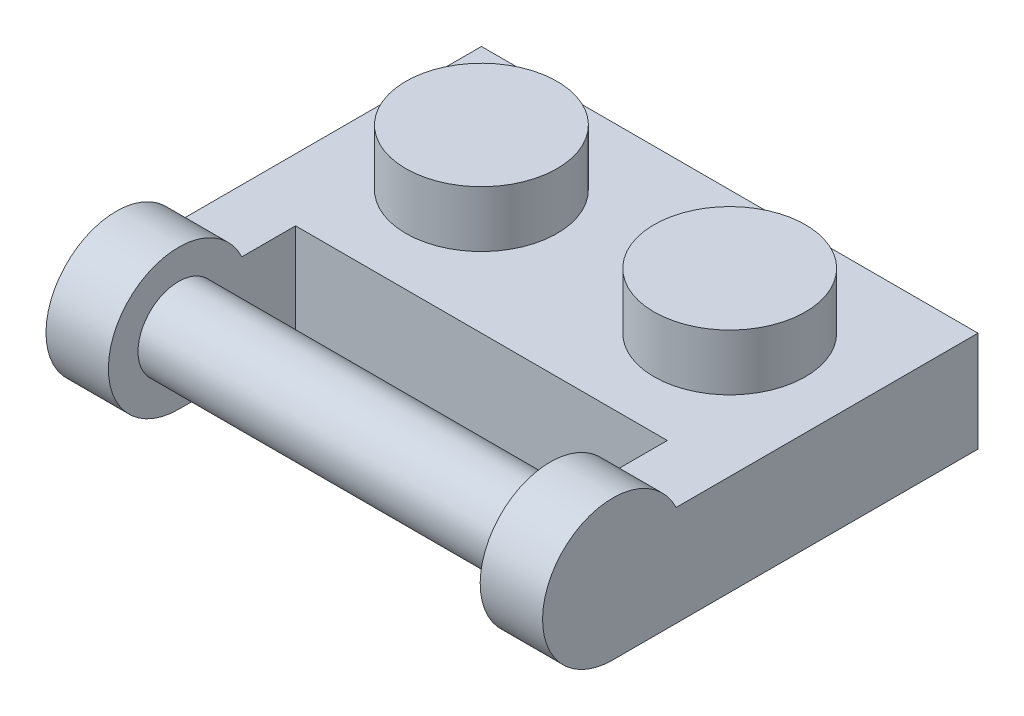
ISO-10303-21;
HEADER;
FILE_DESCRIPTION(('STEP AP214'),'2;1');
FILE_NAME('part.step','',(''),(''),'','','');
FILE_SCHEMA(('AUTOMOTIVE_DESIGN { 1 0 10303 214 1 1 1 1 }'));
ENDSEC;
DATA;
#1=APPLICATION_CONTEXT('core data for automotive mechanical design processes');
#2=APPLICATION_PROTOCOL_DEFINITION('international standard','automotive_design',2000,#1);
#3=PRODUCT_CONTEXT('',#1,'mechanical');
#4=PRODUCT('Part','Part','',(#3));
#5=PRODUCT_RELATED_PRODUCT_CATEGORY('part','',(#4));
#6=PRODUCT_DEFINITION_FORMATION('','',#4);
#7=PRODUCT_DEFINITION_CONTEXT('part definition',#1,'design');
#8=PRODUCT_DEFINITION('design','',#6,#7);
#9=PRODUCT_DEFINITION_SHAPE('','',#8);
#10=(LENGTH_UNIT() NAMED_UNIT(*) SI_UNIT(.MILLI.,.METRE.));
#11=(NAMED_UNIT(*) PLANE_ANGLE_UNIT() SI_UNIT($,.RADIAN.));
#12=(NAMED_UNIT(*) SI_UNIT($,.STERADIAN.) SOLID_ANGLE_UNIT());
#13=UNCERTAINTY_MEASURE_WITH_UNIT(LENGTH_MEASURE(1.E-05),#10,'distance_accuracy_value','');
#14=(GEOMETRIC_REPRESENTATION_CONTEXT(3) GLOBAL_UNCERTAINTY_ASSIGNED_CONTEXT((#13)) GLOBAL_UNIT_ASSIGNED_CONTEXT((#10,
#11,#12)) REPRESENTATION_CONTEXT('',''));
#15=CARTESIAN_POINT('',(0.,0.,0.));
#16=DIRECTION('',(0.,0.,1.));
#17=DIRECTION('',(1.,0.,0.));
#18=AXIS2_PLACEMENT_3D('',#15,#16,#17);
#19=CARTESIAN_POINT('',(-3.98,3.22,3.98));
#20=DIRECTION('',(0.,0.,-1.));
#21=DIRECTION('',(-1.,0.,0.));
#22=AXIS2_PLACEMENT_3D('',#19,#20,#21);
#23=PLANE('',#22);
#24=DIRECTION('',(0.,-1.,0.));
#25=VECTOR('',#24,1.);
#26=CARTESIAN_POINT('',(-1.98,3.22,3.98));
#27=LINE('',#26,#25);
#28=CARTESIAN_POINT('',(-1.98,3.22,3.98));
#29=VERTEX_POINT('',#28);
#30=CARTESIAN_POINT('',(-1.98,0.,3.98000000000001));
#31=VERTEX_POINT('',#30);
#32=EDGE_CURVE('E139',#29,#31,#27,.T.);
#33=ORIENTED_EDGE('',*,*,#32,.T.);
#34=DIRECTION('',(1.,0.,0.));
#35=VECTOR('',#34,1.);
#36=CARTESIAN_POINT('',(-3.98,0.,3.98));
#37=LINE('',#36,#35);
#38=CARTESIAN_POINT('',(9.94,0.,3.98));
#39=VERTEX_POINT('',#38);
#40=EDGE_CURVE('E127',#31,#39,#37,.T.);
#41=ORIENTED_EDGE('',*,*,#40,.T.);
#42=DIRECTION('',(0.,1.,0.));
#43=VECTOR('',#42,1.);
#44=CARTESIAN_POINT('',(9.94,3.22,3.98));
#45=LINE('',#44,#43);
#46=CARTESIAN_POINT('',(9.94,3.22,3.98));
#47=VERTEX_POINT('',#46);
#48=EDGE_CURVE('E166',#39,#47,#45,.T.);
#49=ORIENTED_EDGE('',*,*,#48,.T.);
#50=DIRECTION('',(1.,0.,0.));
#51=VECTOR('',#50,1.);
#52=CARTESIAN_POINT('',(-3.98,3.22,3.98));
#53=LINE('',#52,#51);
#54=EDGE_CURVE('E52',#29,#47,#53,.T.);
#55=ORIENTED_EDGE('',*,*,#54,.F.);
#56=EDGE_LOOP('',(#33,#41,#49,#55));
#57=FACE_BOUND('',#56,.T.);
#58=ADVANCED_FACE('F35',(#57),#23,.F.);
#59=CARTESIAN_POINT('',(10.39,1.81,2.43));
#60=DIRECTION('',(0.,1.,0.));
#61=DIRECTION('',(0.,0.,1.));
#62=AXIS2_PLACEMENT_3D('',#59,#60,#61);
#63=PLANE('',#62);
#64=CARTESIAN_POINT('',(0.,1.81,0.));
#65=DIRECTION('',(0.,1.,0.));
#66=DIRECTION('',(0.,0.,1.));
#67=AXIS2_PLACEMENT_3D('',#64,#65,#66);
#68=CIRCLE('',#67,0.875);
#69=CARTESIAN_POINT('',(0.,1.81,0.875));
#70=VERTEX_POINT('',#69);
#71=EDGE_CURVE('E185',#70,#70,#68,.T.);
#72=ORIENTED_EDGE('',*,*,#71,.T.);
#73=EDGE_LOOP('',(#72));
#74=FACE_BOUND('',#73,.T.);
#75=CARTESIAN_POINT('',(7.96,1.81,0.));
#76=DIRECTION('',(0.,1.,0.));
#77=DIRECTION('',(0.,0.,1.));
#78=AXIS2_PLACEMENT_3D('',#75,#76,#77);
#79=CIRCLE('',#78,0.875);
#80=CARTESIAN_POINT('',(7.96,1.81,0.875));
#81=VERTEX_POINT('',#80);
#82=EDGE_CURVE('E183',#81,#81,#79,.T.);
#83=ORIENTED_EDGE('',*,*,#82,.T.);
#84=EDGE_LOOP('',(#83));
#85=FACE_BOUND('',#84,.T.);
#86=DIRECTION('',(-1.,0.,0.));
#87=VECTOR('',#86,1.);
#88=CARTESIAN_POINT('',(-2.43,1.81,2.43));
#89=LINE('',#88,#87);
#90=CARTESIAN_POINT('',(10.39,1.81,2.43));
#91=VERTEX_POINT('',#90);
#92=CARTESIAN_POINT('',(-2.43,1.81,2.43));
#93=VERTEX_POINT('',#92);
#94=EDGE_CURVE('E608',#91,#93,#89,.T.);
#95=ORIENTED_EDGE('',*,*,#94,.T.);
#96=DIRECTION('',(0.,0.,-1.));
#97=VECTOR('',#96,1.);
#98=CARTESIAN_POINT('',(-2.43,1.81,-2.43));
#99=LINE('',#98,#97);
#100=CARTESIAN_POINT('',(-2.43,1.81,-2.43));
#101=VERTEX_POINT('',#100);
#102=EDGE_CURVE('E199',#93,#101,#99,.T.);
#103=ORIENTED_EDGE('',*,*,#102,.T.);
#104=DIRECTION('',(1.,0.,0.));
#105=VECTOR('',#104,1.);
#106=CARTESIAN_POINT('',(10.39,1.81,-2.43));
#107=LINE('',#106,#105);
#108=CARTESIAN_POINT('',(10.39,1.81,-2.43));
#109=VERTEX_POINT('',#108);
#110=EDGE_CURVE('E193',#101,#109,#107,.T.);
#111=ORIENTED_EDGE('',*,*,#110,.T.);
#112=DIRECTION('',(0.,0.,1.));
#113=VECTOR('',#112,1.);
#114=CARTESIAN_POINT('',(10.39,1.81,2.43));
#115=LINE('',#114,#113);
#116=EDGE_CURVE('E186',#109,#91,#115,.T.);
#117=ORIENTED_EDGE('',*,*,#116,.T.);
#118=EDGE_LOOP('',(#95,#103,#111,#117));
#119=FACE_BOUND('',#118,.T.);
#120=CARTESIAN_POINT('',(3.98,1.81,0.));
#121=DIRECTION('',(0.,1.,0.));
#122=DIRECTION('',(0.,0.,1.));
#123=AXIS2_PLACEMENT_3D('',#120,#121,#122);
#124=CIRCLE('',#123,1.5);
#125=CARTESIAN_POINT('',(3.98,1.81,1.5));
#126=VERTEX_POINT('',#125);
#127=EDGE_CURVE('E11',#126,#126,#124,.F.);
#128=ORIENTED_EDGE('',*,*,#127,.F.);
#129=EDGE_LOOP('',(#128));
#130=FACE_BOUND('',#129,.T.);
#131=ADVANCED_FACE('F283',(#74,#85,#119,#130),#63,.F.);
#132=CARTESIAN_POINT('',(3.98,3.22,3.98));
#133=DIRECTION('',(0.,1.,0.));
#134=DIRECTION('',(0.,0.,1.));
#135=AXIS2_PLACEMENT_3D('',#132,#133,#134);
#136=PLANE('',#135);
#137=CARTESIAN_POINT('',(0.,3.22,0.));
#138=DIRECTION('',(0.,1.,0.));
#139=DIRECTION('',(0.,0.,1.));
#140=AXIS2_PLACEMENT_3D('',#137,#138,#139);
#141=CIRCLE('',#140,2.425);
#142=CARTESIAN_POINT('',(0.,3.22,2.425));
#143=VERTEX_POINT('',#142);
#144=EDGE_CURVE('E245',#143,#143,#141,.T.);
#145=ORIENTED_EDGE('',*,*,#144,.F.);
#146=EDGE_LOOP('',(#145));
#147=FACE_BOUND('',#146,.T.);
#148=DIRECTION('',(0.,0.,1.));
#149=VECTOR('',#148,1.);
#150=CARTESIAN_POINT('',(-3.98,3.22,-3.98));
#151=LINE('',#150,#149);
#152=CARTESIAN_POINT('',(-3.98,3.22,-3.98));
#153=VERTEX_POINT('',#152);
#154=CARTESIAN_POINT('',(-3.98,3.22,5.69982759352808));
#155=VERTEX_POINT('',#154);
#156=EDGE_CURVE('E253',#153,#155,#151,.T.);
#157=ORIENTED_EDGE('',*,*,#156,.T.);
#158=DIRECTION('',(-1.,0.,0.));
#159=VECTOR('',#158,1.);
#160=CARTESIAN_POINT('',(-1.98,3.22,5.69982759352808));
#161=LINE('',#160,#159);
#162=CARTESIAN_POINT('',(-1.98,3.22,5.69982759352808));
#163=VERTEX_POINT('',#162);
#164=EDGE_CURVE('E156',#163,#155,#161,.T.);
#165=ORIENTED_EDGE('',*,*,#164,.F.);
#166=DIRECTION('',(0.,0.,-1.));
#167=VECTOR('',#166,1.);
#168=CARTESIAN_POINT('',(-1.98,3.22,3.98));
#169=LINE('',#168,#167);
#170=EDGE_CURVE('E142',#163,#29,#169,.T.);
#171=ORIENTED_EDGE('',*,*,#170,.T.);
#172=ORIENTED_EDGE('',*,*,#54,.T.);
#173=DIRECTION('',(0.,0.,1.));
#174=VECTOR('',#173,1.);
#175=CARTESIAN_POINT('',(9.94,3.22,3.98));
#176=LINE('',#175,#174);
#177=CARTESIAN_POINT('',(9.94,3.22,5.69982759352808));
#178=VERTEX_POINT('',#177);
#179=EDGE_CURVE('E168',#47,#178,#176,.T.);
#180=ORIENTED_EDGE('',*,*,#179,.T.);
#181=DIRECTION('',(1.,0.,0.));
#182=VECTOR('',#181,1.);
#183=CARTESIAN_POINT('',(9.94,3.22,5.69982759352808));
#184=LINE('',#183,#182);
#185=CARTESIAN_POINT('',(11.94,3.22,5.69982759352808));
#186=VERTEX_POINT('',#185);
#187=EDGE_CURVE('E174',#178,#186,#184,.T.);
#188=ORIENTED_EDGE('',*,*,#187,.T.);
#189=DIRECTION('',(0.,0.,-1.));
#190=VECTOR('',#189,1.);
#191=CARTESIAN_POINT('',(11.94,3.22,-3.98));
#192=LINE('',#191,#190);
#193=CARTESIAN_POINT('',(11.94,3.22,-3.98));
#194=VERTEX_POINT('',#193);
#195=EDGE_CURVE('E237',#186,#194,#192,.T.);
#196=ORIENTED_EDGE('',*,*,#195,.T.);
#197=DIRECTION('',(-1.,0.,0.));
#198=VECTOR('',#197,1.);
#199=CARTESIAN_POINT('',(-3.98,3.22,-3.98));
#200=LINE('',#199,#198);
#201=EDGE_CURVE('E136',#194,#153,#200,.T.);
#202=ORIENTED_EDGE('',*,*,#201,.T.);
#203=EDGE_LOOP('',(#157,#165,#171,#172,#180,#188,#196,#202));
#204=FACE_BOUND('',#203,.T.);
#205=CARTESIAN_POINT('',(7.96,3.22,0.));
#206=DIRECTION('',(0.,1.,0.));
#207=DIRECTION('',(0.,0.,1.));
#208=AXIS2_PLACEMENT_3D('',#205,#206,#207);
#209=CIRCLE('',#208,2.425);
#210=CARTESIAN_POINT('',(7.96,3.22,2.425));
#211=VERTEX_POINT('',#210);
#212=EDGE_CURVE('E205',#211,#211,#209,.T.);
#213=ORIENTED_EDGE('',*,*,#212,.F.);
#214=EDGE_LOOP('',(#213));
#215=FACE_BOUND('',#214,.T.);
#216=ADVANCED_FACE('F264',(#147,#204,#215),#136,.T.);
#217=CARTESIAN_POINT('',(-3.98,3.22,-3.98));
#218=DIRECTION('',(0.,0.,1.));
#219=DIRECTION('',(1.,0.,0.));
#220=AXIS2_PLACEMENT_3D('',#217,#218,#219);
#221=PLANE('',#220);
#222=DIRECTION('',(-1.,0.,0.));
#223=VECTOR('',#222,1.);
#224=CARTESIAN_POINT('',(-3.98,0.,-3.98));
#225=LINE('',#224,#223);
#226=CARTESIAN_POINT('',(11.94,0.,-3.98));
#227=VERTEX_POINT('',#226);
#228=CARTESIAN_POINT('',(-3.98,0.,-3.98));
#229=VERTEX_POINT('',#228);
#230=EDGE_CURVE('E249',#227,#229,#225,.T.);
#231=ORIENTED_EDGE('',*,*,#230,.T.);
#232=DIRECTION('',(0.,-1.,0.));
#233=VECTOR('',#232,1.);
#234=CARTESIAN_POINT('',(-3.98,3.22,-3.98));
#235=LINE('',#234,#233);
#236=EDGE_CURVE('E44',#153,#229,#235,.T.);
#237=ORIENTED_EDGE('',*,*,#236,.F.);
#238=ORIENTED_EDGE('',*,*,#201,.F.);
#239=DIRECTION('',(0.,-1.,0.));
#240=VECTOR('',#239,1.);
#241=CARTESIAN_POINT('',(11.94,3.22,-3.98));
#242=LINE('',#241,#240);
#243=EDGE_CURVE('E240',#194,#227,#242,.T.);
#244=ORIENTED_EDGE('',*,*,#243,.T.);
#245=EDGE_LOOP('',(#231,#237,#238,#244));
#246=FACE_BOUND('',#245,.T.);
#247=ADVANCED_FACE('F37',(#246),#221,.F.);
#248=CARTESIAN_POINT('',(-3.98,3.22,-3.98));
#249=DIRECTION('',(1.,0.,0.));
#250=DIRECTION('',(0.,0.,-1.));
#251=AXIS2_PLACEMENT_3D('',#248,#249,#250);
#252=PLANE('',#251);
#253=DIRECTION('',(0.,0.,1.));
#254=VECTOR('',#253,1.);
#255=CARTESIAN_POINT('',(-3.98,0.,-3.98));
#256=LINE('',#255,#254);
#257=CARTESIAN_POINT('',(-3.98,0.,7.73));
#258=VERTEX_POINT('',#257);
#259=EDGE_CURVE('E137',#229,#258,#256,.T.);
#260=ORIENTED_EDGE('',*,*,#259,.T.);
#261=CARTESIAN_POINT('',(-3.98,2.25,7.73));
#262=DIRECTION('',(-1.,0.,0.));
#263=DIRECTION('',(0.,0.,1.));
#264=AXIS2_PLACEMENT_3D('',#261,#262,#263);
#265=CIRCLE('',#264,2.25);
#266=EDGE_CURVE('E152',#258,#155,#265,.T.);
#267=ORIENTED_EDGE('',*,*,#266,.T.);
#268=ORIENTED_EDGE('',*,*,#156,.F.);
#269=ORIENTED_EDGE('',*,*,#236,.T.);
#270=EDGE_LOOP('',(#260,#267,#268,#269));
#271=FACE_BOUND('',#270,.T.);
#272=ADVANCED_FACE('F259',(#271),#252,.F.);
#273=CARTESIAN_POINT('',(3.98,0.,3.98));
#274=DIRECTION('',(0.,1.,0.));
#275=DIRECTION('',(0.,0.,1.));
#276=AXIS2_PLACEMENT_3D('',#273,#274,#275);
#277=PLANE('',#276);
#278=DIRECTION('',(0.,0.,-1.));
#279=VECTOR('',#278,1.);
#280=CARTESIAN_POINT('',(10.39,0.,-3.98));
#281=LINE('',#280,#279);
#282=CARTESIAN_POINT('',(10.39,0.,2.43));
#283=VERTEX_POINT('',#282);
#284=CARTESIAN_POINT('',(10.39,0.,-2.43));
#285=VERTEX_POINT('',#284);
#286=EDGE_CURVE('E216',#283,#285,#281,.T.);
#287=ORIENTED_EDGE('',*,*,#286,.T.);
#288=DIRECTION('',(-1.,0.,0.));
#289=VECTOR('',#288,1.);
#290=CARTESIAN_POINT('',(-3.98,0.,-2.43));
#291=LINE('',#290,#289);
#292=CARTESIAN_POINT('',(-2.43,0.,-2.43));
#293=VERTEX_POINT('',#292);
#294=EDGE_CURVE('E219',#285,#293,#291,.T.);
#295=ORIENTED_EDGE('',*,*,#294,.T.);
#296=DIRECTION('',(0.,0.,1.));
#297=VECTOR('',#296,1.);
#298=CARTESIAN_POINT('',(-2.43,0.,-3.98));
#299=LINE('',#298,#297);
#300=CARTESIAN_POINT('',(-2.43,0.,2.43));
#301=VERTEX_POINT('',#300);
#302=EDGE_CURVE('E224',#293,#301,#299,.T.);
#303=ORIENTED_EDGE('',*,*,#302,.T.);
#304=DIRECTION('',(1.,0.,0.));
#305=VECTOR('',#304,1.);
#306=CARTESIAN_POINT('',(-3.98,0.,2.43));
#307=LINE('',#306,#305);
#308=EDGE_CURVE('E214',#301,#283,#307,.T.);
#309=ORIENTED_EDGE('',*,*,#308,.T.);
#310=EDGE_LOOP('',(#287,#295,#303,#309));
#311=FACE_BOUND('',#310,.T.);
#312=ORIENTED_EDGE('',*,*,#230,.F.);
#313=DIRECTION('',(0.,0.,-1.));
#314=VECTOR('',#313,1.);
#315=CARTESIAN_POINT('',(11.94,0.,-3.98));
#316=LINE('',#315,#314);
#317=CARTESIAN_POINT('',(11.94,0.,7.73));
#318=VERTEX_POINT('',#317);
#319=EDGE_CURVE('E236',#318,#227,#316,.T.);
#320=ORIENTED_EDGE('',*,*,#319,.F.);
#321=DIRECTION('',(1.,0.,0.));
#322=VECTOR('',#321,1.);
#323=CARTESIAN_POINT('',(9.94,0.,7.73));
#324=LINE('',#323,#322);
#325=CARTESIAN_POINT('',(9.94,0.,7.73));
#326=VERTEX_POINT('',#325);
#327=EDGE_CURVE('E593',#326,#318,#324,.T.);
#328=ORIENTED_EDGE('',*,*,#327,.F.);
#329=DIRECTION('',(0.,0.,-1.));
#330=VECTOR('',#329,1.);
#331=CARTESIAN_POINT('',(9.94,0.,7.73));
#332=LINE('',#331,#330);
#333=EDGE_CURVE('E134',#326,#39,#332,.T.);
#334=ORIENTED_EDGE('',*,*,#333,.T.);
#335=ORIENTED_EDGE('',*,*,#40,.F.);
#336=DIRECTION('',(0.,0.,1.));
#337=VECTOR('',#336,1.);
#338=CARTESIAN_POINT('',(-1.98,0.,7.73));
#339=LINE('',#338,#337);
#340=CARTESIAN_POINT('',(-1.98,0.,7.73));
#341=VERTEX_POINT('',#340);
#342=EDGE_CURVE('E131',#31,#341,#339,.T.);
#343=ORIENTED_EDGE('',*,*,#342,.T.);
#344=DIRECTION('',(-1.,0.,0.));
#345=VECTOR('',#344,1.);
#346=CARTESIAN_POINT('',(-1.98,0.,7.73));
#347=LINE('',#346,#345);
#348=EDGE_CURVE('E148',#341,#258,#347,.T.);
#349=ORIENTED_EDGE('',*,*,#348,.T.);
#350=ORIENTED_EDGE('',*,*,#259,.F.);
#351=EDGE_LOOP('',(#312,#320,#328,#334,#335,#343,#349,#350));
#352=FACE_BOUND('',#351,.T.);
#353=ADVANCED_FACE('F128',(#311,#352),#277,.F.);
#354=CARTESIAN_POINT('',(0.,5.02,0.));
#355=DIRECTION('',(0.,-1.,0.));
#356=DIRECTION('',(0.,0.,-1.));
#357=AXIS2_PLACEMENT_3D('',#354,#355,#356);
#358=CYLINDRICAL_SURFACE('',#357,2.425);
#359=CARTESIAN_POINT('',(0.,5.02,0.));
#360=DIRECTION('',(0.,1.,0.));
#361=DIRECTION('',(0.,0.,1.));
#362=AXIS2_PLACEMENT_3D('',#359,#360,#361);
#363=CIRCLE('',#362,2.425);
#364=CARTESIAN_POINT('',(0.,5.02,2.425));
#365=VERTEX_POINT('',#364);
#366=EDGE_CURVE('E246',#365,#365,#363,.T.);
#367=ORIENTED_EDGE('',*,*,#366,.F.);
#368=EDGE_LOOP('',(#367));
#369=FACE_BOUND('',#368,.T.);
#370=ORIENTED_EDGE('',*,*,#144,.T.);
#371=EDGE_LOOP('',(#370));
#372=FACE_BOUND('',#371,.T.);
#373=ADVANCED_FACE('F298',(#369,#372),#358,.T.);
#374=CARTESIAN_POINT('',(0.,5.02,0.));
#375=DIRECTION('',(0.,1.,0.));
#376=DIRECTION('',(0.,0.,1.));
#377=AXIS2_PLACEMENT_3D('',#374,#375,#376);
#378=PLANE('',#377);
#379=ORIENTED_EDGE('',*,*,#366,.T.);
#380=EDGE_LOOP('',(#379));
#381=FACE_BOUND('',#380,.T.);
#382=ADVANCED_FACE('F310',(#381),#378,.T.);
#383=CARTESIAN_POINT('',(11.94,3.22,-3.98));
#384=DIRECTION('',(-1.,0.,0.));
#385=DIRECTION('',(0.,0.,1.));
#386=AXIS2_PLACEMENT_3D('',#383,#384,#385);
#387=PLANE('',#386);
#388=ORIENTED_EDGE('',*,*,#319,.T.);
#389=ORIENTED_EDGE('',*,*,#243,.F.);
#390=ORIENTED_EDGE('',*,*,#195,.F.);
#391=CARTESIAN_POINT('',(11.94,2.25,7.73));
#392=DIRECTION('',(1.,0.,0.));
#393=DIRECTION('',(0.,0.,-1.));
#394=AXIS2_PLACEMENT_3D('',#391,#392,#393);
#395=CIRCLE('',#394,2.25);
#396=EDGE_CURVE('E159',#186,#318,#395,.T.);
#397=ORIENTED_EDGE('',*,*,#396,.T.);
#398=EDGE_LOOP('',(#388,#389,#390,#397));
#399=FACE_BOUND('',#398,.T.);
#400=ADVANCED_FACE('F314',(#399),#387,.F.);
#401=CARTESIAN_POINT('',(7.96,5.02,0.));
#402=DIRECTION('',(0.,-1.,0.));
#403=DIRECTION('',(0.,0.,-1.));
#404=AXIS2_PLACEMENT_3D('',#401,#402,#403);
#405=CYLINDRICAL_SURFACE('',#404,2.425);
#406=CARTESIAN_POINT('',(7.96,5.02,0.));
#407=DIRECTION('',(0.,1.,0.));
#408=DIRECTION('',(0.,0.,1.));
#409=AXIS2_PLACEMENT_3D('',#406,#407,#408);
#410=CIRCLE('',#409,2.425);
#411=CARTESIAN_POINT('',(7.96,5.02,2.425));
#412=VERTEX_POINT('',#411);
#413=EDGE_CURVE('E233',#412,#412,#410,.T.);
#414=ORIENTED_EDGE('',*,*,#413,.F.);
#415=EDGE_LOOP('',(#414));
#416=FACE_BOUND('',#415,.T.);
#417=ORIENTED_EDGE('',*,*,#212,.T.);
#418=EDGE_LOOP('',(#417));
#419=FACE_BOUND('',#418,.T.);
#420=ADVANCED_FACE('F318',(#416,#419),#405,.T.);
#421=CARTESIAN_POINT('',(7.96,5.02,0.));
#422=DIRECTION('',(0.,1.,0.));
#423=DIRECTION('',(0.,0.,1.));
#424=AXIS2_PLACEMENT_3D('',#421,#422,#423);
#425=PLANE('',#424);
#426=ORIENTED_EDGE('',*,*,#413,.T.);
#427=EDGE_LOOP('',(#426));
#428=FACE_BOUND('',#427,.T.);
#429=ADVANCED_FACE('F320',(#428),#425,.T.);
#430=CARTESIAN_POINT('',(-3.98,3.22,-2.43));
#431=DIRECTION('',(0.,0.,1.));
#432=DIRECTION('',(1.,0.,0.));
#433=AXIS2_PLACEMENT_3D('',#430,#431,#432);
#434=PLANE('',#433);
#435=ORIENTED_EDGE('',*,*,#294,.F.);
#436=DIRECTION('',(0.,-1.,0.));
#437=VECTOR('',#436,1.);
#438=CARTESIAN_POINT('',(10.39,3.22,-2.43));
#439=LINE('',#438,#437);
#440=EDGE_CURVE('E207',#109,#285,#439,.T.);
#441=ORIENTED_EDGE('',*,*,#440,.F.);
#442=ORIENTED_EDGE('',*,*,#110,.F.);
#443=DIRECTION('',(0.,-1.,0.));
#444=VECTOR('',#443,1.);
#445=CARTESIAN_POINT('',(-2.43,3.22,-2.43));
#446=LINE('',#445,#444);
#447=EDGE_CURVE('E203',#101,#293,#446,.T.);
#448=ORIENTED_EDGE('',*,*,#447,.T.);
#449=EDGE_LOOP('',(#435,#441,#442,#448));
#450=FACE_BOUND('',#449,.T.);
#451=ADVANCED_FACE('F324',(#450),#434,.T.);
#452=CARTESIAN_POINT('',(-2.43,3.22,-3.98));
#453=DIRECTION('',(1.,0.,0.));
#454=DIRECTION('',(0.,0.,-1.));
#455=AXIS2_PLACEMENT_3D('',#452,#453,#454);
#456=PLANE('',#455);
#457=ORIENTED_EDGE('',*,*,#302,.F.);
#458=ORIENTED_EDGE('',*,*,#447,.F.);
#459=ORIENTED_EDGE('',*,*,#102,.F.);
#460=DIRECTION('',(0.,-1.,0.));
#461=VECTOR('',#460,1.);
#462=CARTESIAN_POINT('',(-2.43,3.22,2.43));
#463=LINE('',#462,#461);
#464=EDGE_CURVE('E206',#93,#301,#463,.T.);
#465=ORIENTED_EDGE('',*,*,#464,.T.);
#466=EDGE_LOOP('',(#457,#458,#459,#465));
#467=FACE_BOUND('',#466,.T.);
#468=ADVANCED_FACE('F352',(#467),#456,.T.);
#469=CARTESIAN_POINT('',(-3.98,3.22,2.43));
#470=DIRECTION('',(0.,0.,-1.));
#471=DIRECTION('',(-1.,0.,0.));
#472=AXIS2_PLACEMENT_3D('',#469,#470,#471);
#473=PLANE('',#472);
#474=ORIENTED_EDGE('',*,*,#308,.F.);
#475=ORIENTED_EDGE('',*,*,#464,.F.);
#476=ORIENTED_EDGE('',*,*,#94,.F.);
#477=DIRECTION('',(0.,-1.,0.));
#478=VECTOR('',#477,1.);
#479=CARTESIAN_POINT('',(10.39,3.22,2.43));
#480=LINE('',#479,#478);
#481=EDGE_CURVE('E211',#91,#283,#480,.T.);
#482=ORIENTED_EDGE('',*,*,#481,.T.);
#483=EDGE_LOOP('',(#474,#475,#476,#482));
#484=FACE_BOUND('',#483,.T.);
#485=ADVANCED_FACE('F342',(#484),#473,.T.);
#486=CARTESIAN_POINT('',(10.39,3.22,-3.98));
#487=DIRECTION('',(-1.,0.,0.));
#488=DIRECTION('',(0.,0.,1.));
#489=AXIS2_PLACEMENT_3D('',#486,#487,#488);
#490=PLANE('',#489);
#491=ORIENTED_EDGE('',*,*,#286,.F.);
#492=ORIENTED_EDGE('',*,*,#481,.F.);
#493=ORIENTED_EDGE('',*,*,#116,.F.);
#494=ORIENTED_EDGE('',*,*,#440,.T.);
#495=EDGE_LOOP('',(#491,#492,#493,#494));
#496=FACE_BOUND('',#495,.T.);
#497=ADVANCED_FACE('F338',(#496),#490,.T.);
#498=CARTESIAN_POINT('',(0.,3.47,0.));
#499=DIRECTION('',(0.,1.,0.));
#500=DIRECTION('',(0.,0.,1.));
#501=AXIS2_PLACEMENT_3D('',#498,#499,#500);
#502=PLANE('',#501);
#503=CARTESIAN_POINT('',(0.,3.47,0.));
#504=DIRECTION('',(0.,1.,0.));
#505=DIRECTION('',(0.,0.,1.));
#506=AXIS2_PLACEMENT_3D('',#503,#504,#505);
#507=CIRCLE('',#506,0.875);
#508=CARTESIAN_POINT('',(0.,3.47,0.875));
#509=VERTEX_POINT('',#508);
#510=EDGE_CURVE('E210',#509,#509,#507,.T.);
#511=ORIENTED_EDGE('',*,*,#510,.F.);
#512=EDGE_LOOP('',(#511));
#513=FACE_BOUND('',#512,.T.);
#514=ADVANCED_FACE('F341',(#513),#502,.F.);
#515=CARTESIAN_POINT('',(0.,5.02,0.));
#516=DIRECTION('',(0.,-1.,0.));
#517=DIRECTION('',(0.,0.,-1.));
#518=AXIS2_PLACEMENT_3D('',#515,#516,#517);
#519=CYLINDRICAL_SURFACE('',#518,0.875);
#520=ORIENTED_EDGE('',*,*,#71,.F.);
#521=EDGE_LOOP('',(#520));
#522=FACE_BOUND('',#521,.T.);
#523=ORIENTED_EDGE('',*,*,#510,.T.);
#524=EDGE_LOOP('',(#523));
#525=FACE_BOUND('',#524,.T.);
#526=ADVANCED_FACE('F332',(#522,#525),#519,.F.);
#527=CARTESIAN_POINT('',(7.96,3.47,0.));
#528=DIRECTION('',(0.,1.,0.));
#529=DIRECTION('',(0.,0.,1.));
#530=AXIS2_PLACEMENT_3D('',#527,#528,#529);
#531=PLANE('',#530);
#532=CARTESIAN_POINT('',(7.96,3.47,0.));
#533=DIRECTION('',(0.,1.,0.));
#534=DIRECTION('',(0.,0.,1.));
#535=AXIS2_PLACEMENT_3D('',#532,#533,#534);
#536=CIRCLE('',#535,0.875);
#537=CARTESIAN_POINT('',(7.96,3.47,0.875));
#538=VERTEX_POINT('',#537);
#539=EDGE_CURVE('E190',#538,#538,#536,.T.);
#540=ORIENTED_EDGE('',*,*,#539,.F.);
#541=EDGE_LOOP('',(#540));
#542=FACE_BOUND('',#541,.T.);
#543=ADVANCED_FACE('F328',(#542),#531,.F.);
#544=CARTESIAN_POINT('',(7.96,5.02,0.));
#545=DIRECTION('',(0.,-1.,0.));
#546=DIRECTION('',(0.,0.,-1.));
#547=AXIS2_PLACEMENT_3D('',#544,#545,#546);
#548=CYLINDRICAL_SURFACE('',#547,0.875);
#549=ORIENTED_EDGE('',*,*,#82,.F.);
#550=EDGE_LOOP('',(#549));
#551=FACE_BOUND('',#550,.T.);
#552=ORIENTED_EDGE('',*,*,#539,.T.);
#553=EDGE_LOOP('',(#552));
#554=FACE_BOUND('',#553,.T.);
#555=ADVANCED_FACE('F331',(#551,#554),#548,.F.);
#556=CARTESIAN_POINT('',(3.98,-4.24264068711928,0.));
#557=DIRECTION('',(0.,1.,0.));
#558=DIRECTION('',(0.,0.,1.));
#559=AXIS2_PLACEMENT_3D('',#556,#557,#558);
#560=CYLINDRICAL_SURFACE('',#559,1.5);
#561=CARTESIAN_POINT('',(3.98,0.,0.));
#562=DIRECTION('',(0.,1.,0.));
#563=DIRECTION('',(0.,0.,1.));
#564=AXIS2_PLACEMENT_3D('',#561,#562,#563);
#565=CIRCLE('',#564,1.5);
#566=CARTESIAN_POINT('',(3.98,0.,1.5));
#567=VERTEX_POINT('',#566);
#568=EDGE_CURVE('E602',#567,#567,#565,.T.);
#569=ORIENTED_EDGE('',*,*,#568,.T.);
#570=EDGE_LOOP('',(#569));
#571=FACE_BOUND('',#570,.T.);
#572=ORIENTED_EDGE('',*,*,#127,.T.);
#573=EDGE_LOOP('',(#572));
#574=FACE_BOUND('',#573,.T.);
#575=ADVANCED_FACE('F336',(#571,#574),#560,.T.);
#576=CARTESIAN_POINT('',(3.98,-4.24264068711928,0.));
#577=DIRECTION('',(0.,1.,0.));
#578=DIRECTION('',(0.,0.,1.));
#579=AXIS2_PLACEMENT_3D('',#576,#577,#578);
#580=CYLINDRICAL_SURFACE('',#579,0.64);
#581=CARTESIAN_POINT('',(3.98,0.,0.));
#582=DIRECTION('',(0.,1.,0.));
#583=DIRECTION('',(0.,0.,1.));
#584=AXIS2_PLACEMENT_3D('',#581,#582,#583);
#585=CIRCLE('',#584,0.64);
#586=CARTESIAN_POINT('',(3.98,0.,0.64));
#587=VERTEX_POINT('',#586);
#588=EDGE_CURVE('E605',#587,#587,#585,.T.);
#589=ORIENTED_EDGE('',*,*,#588,.F.);
#590=EDGE_LOOP('',(#589));
#591=FACE_BOUND('',#590,.T.);
#592=CARTESIAN_POINT('',(3.98,1.81,0.));
#593=DIRECTION('',(0.,-1.,0.));
#594=DIRECTION('',(0.,0.,-1.));
#595=AXIS2_PLACEMENT_3D('',#592,#593,#594);
#596=CIRCLE('',#595,0.64);
#597=CARTESIAN_POINT('',(3.98,1.81,-0.64));
#598=VERTEX_POINT('',#597);
#599=EDGE_CURVE('E598',#598,#598,#596,.T.);
#600=ORIENTED_EDGE('',*,*,#599,.F.);
#601=EDGE_LOOP('',(#600));
#602=FACE_BOUND('',#601,.T.);
#603=ADVANCED_FACE('F366',(#591,#602),#580,.F.);
#604=CARTESIAN_POINT('',(3.98,0.,3.98));
#605=DIRECTION('',(0.,1.,0.));
#606=DIRECTION('',(0.,0.,1.));
#607=AXIS2_PLACEMENT_3D('',#604,#605,#606);
#608=PLANE('',#607);
#609=ORIENTED_EDGE('',*,*,#588,.T.);
#610=EDGE_LOOP('',(#609));
#611=FACE_BOUND('',#610,.T.);
#612=ORIENTED_EDGE('',*,*,#568,.F.);
#613=EDGE_LOOP('',(#612));
#614=FACE_BOUND('',#613,.T.);
#615=ADVANCED_FACE('F362',(#611,#614),#608,.F.);
#616=ORIENTED_EDGE('',*,*,#599,.T.);
#617=EDGE_LOOP('',(#616));
#618=FACE_BOUND('',#617,.T.);
#619=ADVANCED_FACE('F290',(#618),#63,.F.);
#620=CARTESIAN_POINT('',(9.94,2.25,7.73));
#621=DIRECTION('',(1.,0.,0.));
#622=DIRECTION('',(0.,0.,-1.));
#623=AXIS2_PLACEMENT_3D('',#620,#621,#622);
#624=CYLINDRICAL_SURFACE('',#623,2.25);
#625=ORIENTED_EDGE('',*,*,#396,.F.);
#626=ORIENTED_EDGE('',*,*,#187,.F.);
#627=CARTESIAN_POINT('',(9.94,2.25,7.73));
#628=DIRECTION('',(1.,0.,0.));
#629=DIRECTION('',(0.,0.,-1.));
#630=AXIS2_PLACEMENT_3D('',#627,#628,#629);
#631=CIRCLE('',#630,2.25);
#632=EDGE_CURVE('E163',#178,#326,#631,.T.);
#633=ORIENTED_EDGE('',*,*,#632,.T.);
#634=ORIENTED_EDGE('',*,*,#327,.T.);
#635=EDGE_LOOP('',(#625,#626,#633,#634));
#636=FACE_BOUND('',#635,.T.);
#637=ADVANCED_FACE('F361',(#636),#624,.T.);
#638=CARTESIAN_POINT('',(9.94,2.25,7.73));
#639=DIRECTION('',(1.,0.,0.));
#640=DIRECTION('',(0.,0.,-1.));
#641=AXIS2_PLACEMENT_3D('',#638,#639,#640);
#642=PLANE('',#641);
#643=CARTESIAN_POINT('',(9.94,2.25,7.73));
#644=DIRECTION('',(1.,0.,0.));
#645=DIRECTION('',(0.,0.,-1.));
#646=AXIS2_PLACEMENT_3D('',#643,#644,#645);
#647=CIRCLE('',#646,1.3);
#648=CARTESIAN_POINT('',(9.94,2.25,6.43));
#649=VERTEX_POINT('',#648);
#650=EDGE_CURVE('E155',#649,#649,#647,.T.);
#651=ORIENTED_EDGE('',*,*,#650,.T.);
#652=EDGE_LOOP('',(#651));
#653=FACE_BOUND('',#652,.T.);
#654=ORIENTED_EDGE('',*,*,#48,.F.);
#655=ORIENTED_EDGE('',*,*,#333,.F.);
#656=ORIENTED_EDGE('',*,*,#632,.F.);
#657=ORIENTED_EDGE('',*,*,#179,.F.);
#658=EDGE_LOOP('',(#654,#655,#656,#657));
#659=FACE_BOUND('',#658,.T.);
#660=ADVANCED_FACE('F376',(#653,#659),#642,.F.);
#661=CARTESIAN_POINT('',(-1.98,2.25,7.73));
#662=DIRECTION('',(-1.,0.,0.));
#663=DIRECTION('',(0.,0.,1.));
#664=AXIS2_PLACEMENT_3D('',#661,#662,#663);
#665=CYLINDRICAL_SURFACE('',#664,2.25);
#666=ORIENTED_EDGE('',*,*,#266,.F.);
#667=ORIENTED_EDGE('',*,*,#348,.F.);
#668=CARTESIAN_POINT('',(-1.98,2.25,7.73));
#669=DIRECTION('',(-1.,0.,0.));
#670=DIRECTION('',(0.,0.,1.));
#671=AXIS2_PLACEMENT_3D('',#668,#669,#670);
#672=CIRCLE('',#671,2.25);
#673=EDGE_CURVE('E146',#341,#163,#672,.T.);
#674=ORIENTED_EDGE('',*,*,#673,.T.);
#675=ORIENTED_EDGE('',*,*,#164,.T.);
#676=EDGE_LOOP('',(#666,#667,#674,#675));
#677=FACE_BOUND('',#676,.T.);
#678=ADVANCED_FACE('F263',(#677),#665,.T.);
#679=CARTESIAN_POINT('',(-1.98,2.25,7.73));
#680=DIRECTION('',(-1.,0.,0.));
#681=DIRECTION('',(0.,0.,1.));
#682=AXIS2_PLACEMENT_3D('',#679,#680,#681);
#683=PLANE('',#682);
#684=CARTESIAN_POINT('',(-1.98,2.25,7.73));
#685=DIRECTION('',(-1.,0.,0.));
#686=DIRECTION('',(0.,0.,1.));
#687=AXIS2_PLACEMENT_3D('',#684,#685,#686);
#688=CIRCLE('',#687,1.3);
#689=CARTESIAN_POINT('',(-1.98,2.25,9.03));
#690=VERTEX_POINT('',#689);
#691=EDGE_CURVE('E39',#690,#690,#688,.T.);
#692=ORIENTED_EDGE('',*,*,#691,.T.);
#693=EDGE_LOOP('',(#692));
#694=FACE_BOUND('',#693,.T.);
#695=ORIENTED_EDGE('',*,*,#170,.F.);
#696=ORIENTED_EDGE('',*,*,#673,.F.);
#697=ORIENTED_EDGE('',*,*,#342,.F.);
#698=ORIENTED_EDGE('',*,*,#32,.F.);
#699=EDGE_LOOP('',(#695,#696,#697,#698));
#700=FACE_BOUND('',#699,.T.);
#701=ADVANCED_FACE('F144',(#694,#700),#683,.F.);
#702=CARTESIAN_POINT('',(15.61695526217,2.25,7.73));
#703=DIRECTION('',(-1.,0.,0.));
#704=DIRECTION('',(0.,0.,1.));
#705=AXIS2_PLACEMENT_3D('',#702,#703,#704);
#706=CYLINDRICAL_SURFACE('',#705,1.3);
#707=ORIENTED_EDGE('',*,*,#691,.F.);
#708=EDGE_LOOP('',(#707));
#709=FACE_BOUND('',#708,.T.);
#710=ORIENTED_EDGE('',*,*,#650,.F.);
#711=EDGE_LOOP('',(#710));
#712=FACE_BOUND('',#711,.T.);
#713=ADVANCED_FACE('F274',(#709,#712),#706,.T.);
#714=CLOSED_SHELL('',(#58,#131,#216,#247,#272,#353,#373,#382,#400,#420,#429,#451,#468,#485,#497,
#514,#526,#543,#555,#575,#603,#615,#619,#637,#660,#678,#701,#713));
#715=MANIFOLD_SOLID_BREP('B2',#714);
#716=ADVANCED_BREP_SHAPE_REPRESENTATION('',(#18,#715),#14);
#717=SHAPE_DEFINITION_REPRESENTATION(#9,#716);
ENDSEC;
END-ISO-10303-21;
